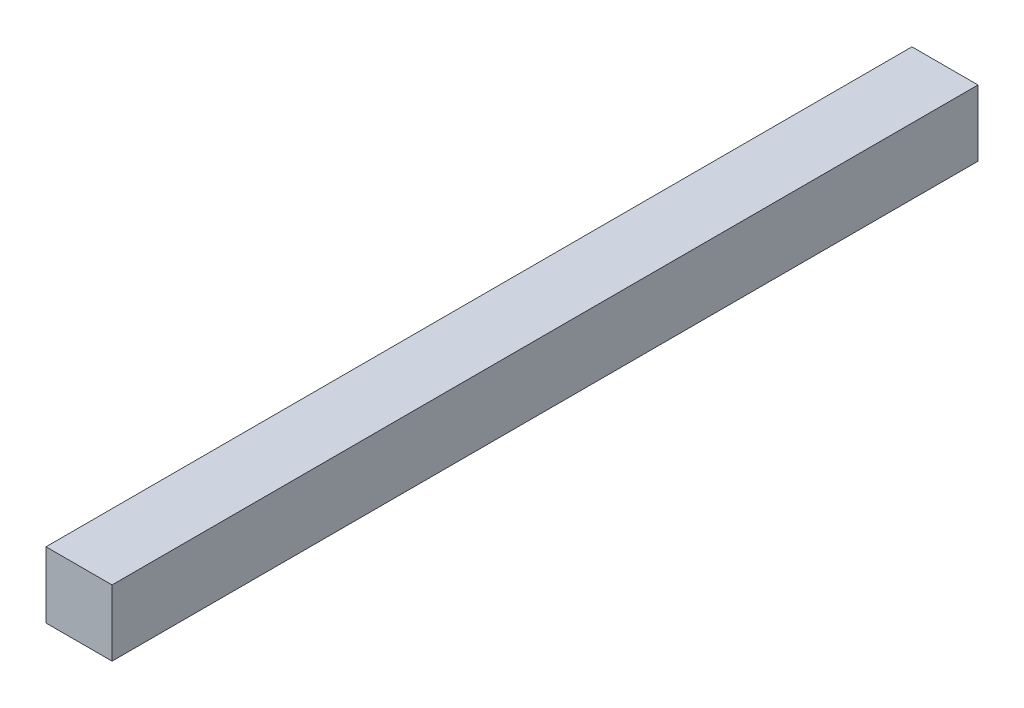
ISO-10303-21;
HEADER;
FILE_DESCRIPTION(('STEP AP214'),'2;1');
FILE_NAME('part.step','',(''),(''),'','','');
FILE_SCHEMA(('AUTOMOTIVE_DESIGN { 1 0 10303 214 1 1 1 1 }'));
ENDSEC;
DATA;
#1=APPLICATION_CONTEXT('core data for automotive mechanical design processes');
#2=APPLICATION_PROTOCOL_DEFINITION('international standard','automotive_design',2000,#1);
#3=PRODUCT_CONTEXT('',#1,'mechanical');
#4=PRODUCT('Part','Part','',(#3));
#5=PRODUCT_RELATED_PRODUCT_CATEGORY('part','',(#4));
#6=PRODUCT_DEFINITION_FORMATION('','',#4);
#7=PRODUCT_DEFINITION_CONTEXT('part definition',#1,'design');
#8=PRODUCT_DEFINITION('design','',#6,#7);
#9=PRODUCT_DEFINITION_SHAPE('','',#8);
#10=(LENGTH_UNIT() NAMED_UNIT(*) SI_UNIT(.MILLI.,.METRE.));
#11=(NAMED_UNIT(*) PLANE_ANGLE_UNIT() SI_UNIT($,.RADIAN.));
#12=(NAMED_UNIT(*) SI_UNIT($,.STERADIAN.) SOLID_ANGLE_UNIT());
#13=UNCERTAINTY_MEASURE_WITH_UNIT(LENGTH_MEASURE(1.E-05),#10,'distance_accuracy_value','');
#14=(GEOMETRIC_REPRESENTATION_CONTEXT(3) GLOBAL_UNCERTAINTY_ASSIGNED_CONTEXT((#13)) GLOBAL_UNIT_ASSIGNED_CONTEXT((#10,
#11,#12)) REPRESENTATION_CONTEXT('',''));
#15=CARTESIAN_POINT('',(0.,0.,0.));
#16=DIRECTION('',(0.,0.,1.));
#17=DIRECTION('',(1.,0.,0.));
#18=AXIS2_PLACEMENT_3D('',#15,#16,#17);
#19=CARTESIAN_POINT('',(295.,373.,295.));
#20=DIRECTION('',(0.,-1.,0.));
#21=DIRECTION('',(0.,0.,-1.));
#22=AXIS2_PLACEMENT_3D('',#19,#20,#21);
#23=PLANE('',#22);
#24=DIRECTION('',(0.,0.,-1.));
#25=VECTOR('',#24,1.);
#26=CARTESIAN_POINT('',(340.,373.,0.));
#27=LINE('',#26,#25);
#28=CARTESIAN_POINT('',(340.,373.,295.));
#29=VERTEX_POINT('',#28);
#30=CARTESIAN_POINT('',(340.,373.,-295.));
#31=VERTEX_POINT('',#30);
#32=EDGE_CURVE('E68',#29,#31,#27,.T.);
#33=ORIENTED_EDGE('',*,*,#32,.F.);
#34=DIRECTION('',(1.,0.,0.));
#35=VECTOR('',#34,1.);
#36=CARTESIAN_POINT('',(295.,373.,295.));
#37=LINE('',#36,#35);
#38=CARTESIAN_POINT('',(295.,373.,295.));
#39=VERTEX_POINT('',#38);
#40=EDGE_CURVE('E55',#39,#29,#37,.T.);
#41=ORIENTED_EDGE('',*,*,#40,.F.);
#42=DIRECTION('',(0.,0.,-1.));
#43=VECTOR('',#42,1.);
#44=CARTESIAN_POINT('',(295.,373.,0.));
#45=LINE('',#44,#43);
#46=CARTESIAN_POINT('',(295.,373.,-295.));
#47=VERTEX_POINT('',#46);
#48=EDGE_CURVE('E20',#39,#47,#45,.T.);
#49=ORIENTED_EDGE('',*,*,#48,.T.);
#50=DIRECTION('',(-1.,0.,0.));
#51=VECTOR('',#50,1.);
#52=CARTESIAN_POINT('',(295.,373.,-295.));
#53=LINE('',#52,#51);
#54=EDGE_CURVE('E81',#31,#47,#53,.T.);
#55=ORIENTED_EDGE('',*,*,#54,.F.);
#56=EDGE_LOOP('',(#33,#41,#49,#55));
#57=FACE_BOUND('',#56,.T.);
#58=ADVANCED_FACE('F17',(#57),#23,.T.);
#59=CARTESIAN_POINT('',(295.,395.5,0.));
#60=DIRECTION('',(1.,0.,0.));
#61=DIRECTION('',(0.,0.,-1.));
#62=AXIS2_PLACEMENT_3D('',#59,#60,#61);
#63=PLANE('',#62);
#64=DIRECTION('',(0.,0.,1.));
#65=VECTOR('',#64,1.);
#66=CARTESIAN_POINT('',(295.,418.,-295.));
#67=LINE('',#66,#65);
#68=CARTESIAN_POINT('',(295.,418.,-295.));
#69=VERTEX_POINT('',#68);
#70=CARTESIAN_POINT('',(295.,418.,295.));
#71=VERTEX_POINT('',#70);
#72=EDGE_CURVE('E83',#69,#71,#67,.T.);
#73=ORIENTED_EDGE('',*,*,#72,.F.);
#74=DIRECTION('',(0.,1.,0.));
#75=VECTOR('',#74,1.);
#76=CARTESIAN_POINT('',(295.,373.,-295.));
#77=LINE('',#76,#75);
#78=EDGE_CURVE('E64',#47,#69,#77,.T.);
#79=ORIENTED_EDGE('',*,*,#78,.F.);
#80=ORIENTED_EDGE('',*,*,#48,.F.);
#81=DIRECTION('',(0.,1.,0.));
#82=VECTOR('',#81,1.);
#83=CARTESIAN_POINT('',(295.,418.,295.));
#84=LINE('',#83,#82);
#85=EDGE_CURVE('E61',#71,#39,#84,.F.);
#86=ORIENTED_EDGE('',*,*,#85,.F.);
#87=EDGE_LOOP('',(#73,#79,#80,#86));
#88=FACE_BOUND('',#87,.T.);
#89=ADVANCED_FACE('F60',(#88),#63,.F.);
#90=CARTESIAN_POINT('',(295.,418.,295.));
#91=DIRECTION('',(0.,0.,1.));
#92=DIRECTION('',(1.,0.,0.));
#93=AXIS2_PLACEMENT_3D('',#90,#91,#92);
#94=PLANE('',#93);
#95=DIRECTION('',(0.,1.,0.));
#96=VECTOR('',#95,1.);
#97=CARTESIAN_POINT('',(340.,395.5,295.));
#98=LINE('',#97,#96);
#99=CARTESIAN_POINT('',(340.,418.,295.));
#100=VERTEX_POINT('',#99);
#101=EDGE_CURVE('E70',#100,#29,#98,.F.);
#102=ORIENTED_EDGE('',*,*,#101,.F.);
#103=DIRECTION('',(1.,0.,0.));
#104=VECTOR('',#103,1.);
#105=CARTESIAN_POINT('',(295.,418.,295.));
#106=LINE('',#105,#104);
#107=EDGE_CURVE('E74',#71,#100,#106,.T.);
#108=ORIENTED_EDGE('',*,*,#107,.F.);
#109=ORIENTED_EDGE('',*,*,#85,.T.);
#110=ORIENTED_EDGE('',*,*,#40,.T.);
#111=EDGE_LOOP('',(#102,#108,#109,#110));
#112=FACE_BOUND('',#111,.T.);
#113=ADVANCED_FACE('F72',(#112),#94,.T.);
#114=CARTESIAN_POINT('',(340.,395.5,0.));
#115=DIRECTION('',(1.,0.,0.));
#116=DIRECTION('',(0.,0.,-1.));
#117=AXIS2_PLACEMENT_3D('',#114,#115,#116);
#118=PLANE('',#117);
#119=DIRECTION('',(0.,1.,0.));
#120=VECTOR('',#119,1.);
#121=CARTESIAN_POINT('',(340.,373.,-295.));
#122=LINE('',#121,#120);
#123=CARTESIAN_POINT('',(340.,418.,-295.));
#124=VERTEX_POINT('',#123);
#125=EDGE_CURVE('E35',#124,#31,#122,.F.);
#126=ORIENTED_EDGE('',*,*,#125,.F.);
#127=DIRECTION('',(0.,0.,1.));
#128=VECTOR('',#127,1.);
#129=CARTESIAN_POINT('',(340.,418.,-295.));
#130=LINE('',#129,#128);
#131=EDGE_CURVE('E26',#100,#124,#130,.F.);
#132=ORIENTED_EDGE('',*,*,#131,.F.);
#133=ORIENTED_EDGE('',*,*,#101,.T.);
#134=ORIENTED_EDGE('',*,*,#32,.T.);
#135=EDGE_LOOP('',(#126,#132,#133,#134));
#136=FACE_BOUND('',#135,.T.);
#137=ADVANCED_FACE('F89',(#136),#118,.T.);
#138=CARTESIAN_POINT('',(295.,373.,-295.));
#139=DIRECTION('',(0.,0.,-1.));
#140=DIRECTION('',(-1.,0.,0.));
#141=AXIS2_PLACEMENT_3D('',#138,#139,#140);
#142=PLANE('',#141);
#143=ORIENTED_EDGE('',*,*,#125,.T.);
#144=ORIENTED_EDGE('',*,*,#54,.T.);
#145=ORIENTED_EDGE('',*,*,#78,.T.);
#146=DIRECTION('',(1.,0.,0.));
#147=VECTOR('',#146,1.);
#148=CARTESIAN_POINT('',(295.,418.,-295.));
#149=LINE('',#148,#147);
#150=EDGE_CURVE('E11',#124,#69,#149,.F.);
#151=ORIENTED_EDGE('',*,*,#150,.F.);
#152=EDGE_LOOP('',(#143,#144,#145,#151));
#153=FACE_BOUND('',#152,.T.);
#154=ADVANCED_FACE('F91',(#153),#142,.T.);
#155=CARTESIAN_POINT('',(295.,418.,-295.));
#156=DIRECTION('',(0.,1.,0.));
#157=DIRECTION('',(0.,0.,1.));
#158=AXIS2_PLACEMENT_3D('',#155,#156,#157);
#159=PLANE('',#158);
#160=ORIENTED_EDGE('',*,*,#131,.T.);
#161=ORIENTED_EDGE('',*,*,#150,.T.);
#162=ORIENTED_EDGE('',*,*,#72,.T.);
#163=ORIENTED_EDGE('',*,*,#107,.T.);
#164=EDGE_LOOP('',(#160,#161,#162,#163));
#165=FACE_BOUND('',#164,.T.);
#166=ADVANCED_FACE('F88',(#165),#159,.T.);
#167=CLOSED_SHELL('',(#58,#89,#113,#137,#154,#166));
#168=MANIFOLD_SOLID_BREP('B1',#167);
#169=ADVANCED_BREP_SHAPE_REPRESENTATION('',(#18,#168),#14);
#170=SHAPE_DEFINITION_REPRESENTATION(#9,#169);
ENDSEC;
END-ISO-10303-21;
